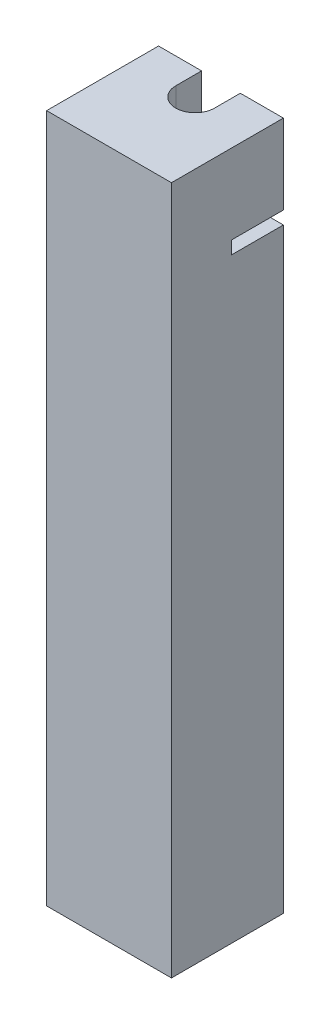
ISO-10303-21;
HEADER;
FILE_DESCRIPTION(('STEP AP214'),'2;1');
FILE_NAME('part.step','',(''),(''),'','','');
FILE_SCHEMA(('AUTOMOTIVE_DESIGN { 1 0 10303 214 1 1 1 1 }'));
ENDSEC;
DATA;
#1=APPLICATION_CONTEXT('core data for automotive mechanical design processes');
#2=APPLICATION_PROTOCOL_DEFINITION('international standard','automotive_design',2000,#1);
#3=PRODUCT_CONTEXT('',#1,'mechanical');
#4=PRODUCT('Part','Part','',(#3));
#5=PRODUCT_RELATED_PRODUCT_CATEGORY('part','',(#4));
#6=PRODUCT_DEFINITION_FORMATION('','',#4);
#7=PRODUCT_DEFINITION_CONTEXT('part definition',#1,'design');
#8=PRODUCT_DEFINITION('design','',#6,#7);
#9=PRODUCT_DEFINITION_SHAPE('','',#8);
#10=(LENGTH_UNIT() NAMED_UNIT(*) SI_UNIT(.MILLI.,.METRE.));
#11=(NAMED_UNIT(*) PLANE_ANGLE_UNIT() SI_UNIT($,.RADIAN.));
#12=(NAMED_UNIT(*) SI_UNIT($,.STERADIAN.) SOLID_ANGLE_UNIT());
#13=UNCERTAINTY_MEASURE_WITH_UNIT(LENGTH_MEASURE(1.E-05),#10,'distance_accuracy_value','');
#14=(GEOMETRIC_REPRESENTATION_CONTEXT(3) GLOBAL_UNCERTAINTY_ASSIGNED_CONTEXT((#13)) GLOBAL_UNIT_ASSIGNED_CONTEXT((#10,
#11,#12)) REPRESENTATION_CONTEXT('',''));
#15=CARTESIAN_POINT('',(0.,0.,0.));
#16=DIRECTION('',(0.,0.,1.));
#17=DIRECTION('',(1.,0.,0.));
#18=AXIS2_PLACEMENT_3D('',#15,#16,#17);
#19=CARTESIAN_POINT('',(0.,-30.75,10.));
#20=DIRECTION('',(0.,-1.,0.));
#21=DIRECTION('',(1.,0.,0.));
#22=AXIS2_PLACEMENT_3D('',#19,#20,#21);
#23=PLANE('',#22);
#24=CARTESIAN_POINT('',(0.,-30.75,0.));
#25=DIRECTION('',(0.,-1.,0.));
#26=DIRECTION('',(1.,0.,0.));
#27=AXIS2_PLACEMENT_3D('',#24,#25,#26);
#28=CIRCLE('',#27,2.25);
#29=CARTESIAN_POINT('',(2.25,-30.75,0.));
#30=VERTEX_POINT('',#29);
#31=EDGE_CURVE('E180',#30,#30,#28,.F.);
#32=ORIENTED_EDGE('',*,*,#31,.T.);
#33=EDGE_LOOP('',(#32));
#34=FACE_BOUND('',#33,.T.);
#35=ADVANCED_FACE('F35',(#34),#23,.F.);
#36=CARTESIAN_POINT('',(2.25,40.,0.));
#37=DIRECTION('',(1.,0.,0.));
#38=DIRECTION('',(0.,0.,-1.));
#39=AXIS2_PLACEMENT_3D('',#36,#37,#38);
#40=PLANE('',#39);
#41=DIRECTION('',(0.,-1.,0.));
#42=VECTOR('',#41,1.);
#43=CARTESIAN_POINT('',(2.25,40.,-3.));
#44=LINE('',#43,#42);
#45=CARTESIAN_POINT('',(2.25,29.25,-3.));
#46=VERTEX_POINT('',#45);
#47=CARTESIAN_POINT('',(2.25,-27.75,-3.));
#48=VERTEX_POINT('',#47);
#49=EDGE_CURVE('E245',#46,#48,#44,.T.);
#50=ORIENTED_EDGE('',*,*,#49,.T.);
#51=DIRECTION('',(0.,0.,-1.));
#52=VECTOR('',#51,1.);
#53=CARTESIAN_POINT('',(2.25,-27.75,0.));
#54=LINE('',#53,#52);
#55=CARTESIAN_POINT('',(2.25,-27.75,0.));
#56=VERTEX_POINT('',#55);
#57=EDGE_CURVE('E50',#56,#48,#54,.T.);
#58=ORIENTED_EDGE('',*,*,#57,.F.);
#59=DIRECTION('',(0.,-1.,0.));
#60=VECTOR('',#59,1.);
#61=CARTESIAN_POINT('',(2.25,40.,0.));
#62=LINE('',#61,#60);
#63=CARTESIAN_POINT('',(2.25,29.25,0.));
#64=VERTEX_POINT('',#63);
#65=EDGE_CURVE('E241',#64,#56,#62,.T.);
#66=ORIENTED_EDGE('',*,*,#65,.F.);
#67=DIRECTION('',(0.,0.,-1.));
#68=VECTOR('',#67,1.);
#69=CARTESIAN_POINT('',(2.25,29.25,0.));
#70=LINE('',#69,#68);
#71=EDGE_CURVE('E200',#64,#46,#70,.T.);
#72=ORIENTED_EDGE('',*,*,#71,.T.);
#73=EDGE_LOOP('',(#50,#58,#66,#72));
#74=FACE_BOUND('',#73,.T.);
#75=ADVANCED_FACE('F300',(#74),#40,.F.);
#76=CARTESIAN_POINT('',(0.,40.,0.));
#77=DIRECTION('',(0.,-1.,0.));
#78=DIRECTION('',(0.,0.,-1.));
#79=AXIS2_PLACEMENT_3D('',#76,#77,#78);
#80=CYLINDRICAL_SURFACE('',#79,2.25);
#81=ORIENTED_EDGE('',*,*,#31,.F.);
#82=EDGE_LOOP('',(#81));
#83=FACE_BOUND('',#82,.T.);
#84=ORIENTED_EDGE('',*,*,#65,.T.);
#85=CARTESIAN_POINT('',(0.,-27.75,0.));
#86=DIRECTION('',(0.,-1.,0.));
#87=DIRECTION('',(-1.,0.,0.));
#88=AXIS2_PLACEMENT_3D('',#85,#86,#87);
#89=CIRCLE('',#88,2.25);
#90=CARTESIAN_POINT('',(-2.25,-27.75,0.));
#91=VERTEX_POINT('',#90);
#92=EDGE_CURVE('E305',#91,#56,#89,.T.);
#93=ORIENTED_EDGE('',*,*,#92,.F.);
#94=DIRECTION('',(0.,-1.,0.));
#95=VECTOR('',#94,1.);
#96=CARTESIAN_POINT('',(-2.25,40.,0.));
#97=LINE('',#96,#95);
#98=CARTESIAN_POINT('',(-2.25,29.25,0.));
#99=VERTEX_POINT('',#98);
#100=EDGE_CURVE('E58',#99,#91,#97,.T.);
#101=ORIENTED_EDGE('',*,*,#100,.F.);
#102=CARTESIAN_POINT('',(0.,29.25,0.));
#103=DIRECTION('',(0.,-1.,0.));
#104=DIRECTION('',(0.,0.,-1.));
#105=AXIS2_PLACEMENT_3D('',#102,#103,#104);
#106=CIRCLE('',#105,2.25);
#107=EDGE_CURVE('E197',#99,#64,#106,.F.);
#108=ORIENTED_EDGE('',*,*,#107,.T.);
#109=EDGE_LOOP('',(#84,#93,#101,#108));
#110=FACE_BOUND('',#109,.T.);
#111=ADVANCED_FACE('F315',(#83,#110),#80,.F.);
#112=CARTESIAN_POINT('',(-2.25,40.,0.));
#113=DIRECTION('',(-1.,0.,0.));
#114=DIRECTION('',(0.,0.,1.));
#115=AXIS2_PLACEMENT_3D('',#112,#113,#114);
#116=PLANE('',#115);
#117=ORIENTED_EDGE('',*,*,#100,.T.);
#118=DIRECTION('',(0.,0.,1.));
#119=VECTOR('',#118,1.);
#120=CARTESIAN_POINT('',(-2.25,-27.75,-3.));
#121=LINE('',#120,#119);
#122=CARTESIAN_POINT('',(-2.25,-27.75,-3.));
#123=VERTEX_POINT('',#122);
#124=EDGE_CURVE('E307',#123,#91,#121,.T.);
#125=ORIENTED_EDGE('',*,*,#124,.F.);
#126=DIRECTION('',(0.,-1.,0.));
#127=VECTOR('',#126,1.);
#128=CARTESIAN_POINT('',(-2.25,40.,-3.));
#129=LINE('',#128,#127);
#130=CARTESIAN_POINT('',(-2.25,29.25,-3.));
#131=VERTEX_POINT('',#130);
#132=EDGE_CURVE('E234',#131,#123,#129,.T.);
#133=ORIENTED_EDGE('',*,*,#132,.F.);
#134=DIRECTION('',(0.,0.,1.));
#135=VECTOR('',#134,1.);
#136=CARTESIAN_POINT('',(-2.25,29.25,0.));
#137=LINE('',#136,#135);
#138=EDGE_CURVE('E195',#131,#99,#137,.T.);
#139=ORIENTED_EDGE('',*,*,#138,.T.);
#140=EDGE_LOOP('',(#117,#125,#133,#139));
#141=FACE_BOUND('',#140,.T.);
#142=ADVANCED_FACE('F318',(#141),#116,.F.);
#143=CARTESIAN_POINT('',(2.25,40.,-3.));
#144=DIRECTION('',(0.,0.,1.));
#145=DIRECTION('',(1.,0.,0.));
#146=AXIS2_PLACEMENT_3D('',#143,#144,#145);
#147=PLANE('',#146);
#148=DIRECTION('',(-1.,0.,0.));
#149=VECTOR('',#148,1.);
#150=CARTESIAN_POINT('',(0.,30.75,-3.));
#151=LINE('',#150,#149);
#152=CARTESIAN_POINT('',(7.25,30.75,-3.));
#153=VERTEX_POINT('',#152);
#154=CARTESIAN_POINT('',(2.25,30.75,-3.));
#155=VERTEX_POINT('',#154);
#156=EDGE_CURVE('E168',#153,#155,#151,.T.);
#157=ORIENTED_EDGE('',*,*,#156,.T.);
#158=CARTESIAN_POINT('',(2.25,40.,-3.));
#159=VERTEX_POINT('',#158);
#160=EDGE_CURVE('E246',#159,#155,#44,.T.);
#161=ORIENTED_EDGE('',*,*,#160,.F.);
#162=DIRECTION('',(-1.,0.,0.));
#163=VECTOR('',#162,1.);
#164=CARTESIAN_POINT('',(2.25,40.,-3.));
#165=LINE('',#164,#163);
#166=CARTESIAN_POINT('',(7.25,40.,-3.));
#167=VERTEX_POINT('',#166);
#168=EDGE_CURVE('E212',#167,#159,#165,.T.);
#169=ORIENTED_EDGE('',*,*,#168,.F.);
#170=DIRECTION('',(0.,-1.,0.));
#171=VECTOR('',#170,1.);
#172=CARTESIAN_POINT('',(7.25,40.,-3.));
#173=LINE('',#172,#171);
#174=EDGE_CURVE('E250',#167,#153,#173,.T.);
#175=ORIENTED_EDGE('',*,*,#174,.T.);
#176=EDGE_LOOP('',(#157,#161,#169,#175));
#177=FACE_BOUND('',#176,.T.);
#178=ADVANCED_FACE('F285',(#177),#147,.F.);
#179=DIRECTION('',(0.,0.,-1.));
#180=VECTOR('',#179,1.);
#181=CARTESIAN_POINT('',(2.25,30.75,0.));
#182=LINE('',#181,#180);
#183=CARTESIAN_POINT('',(2.25,30.75,0.));
#184=VERTEX_POINT('',#183);
#185=EDGE_CURVE('E193',#184,#155,#182,.T.);
#186=ORIENTED_EDGE('',*,*,#185,.F.);
#187=CARTESIAN_POINT('',(2.25,40.,0.));
#188=VERTEX_POINT('',#187);
#189=EDGE_CURVE('E242',#188,#184,#62,.T.);
#190=ORIENTED_EDGE('',*,*,#189,.F.);
#191=DIRECTION('',(0.,0.,1.));
#192=VECTOR('',#191,1.);
#193=CARTESIAN_POINT('',(2.25,40.,0.));
#194=LINE('',#193,#192);
#195=EDGE_CURVE('E214',#159,#188,#194,.T.);
#196=ORIENTED_EDGE('',*,*,#195,.F.);
#197=ORIENTED_EDGE('',*,*,#160,.T.);
#198=EDGE_LOOP('',(#186,#190,#196,#197));
#199=FACE_BOUND('',#198,.T.);
#200=ADVANCED_FACE('F281',(#199),#40,.F.);
#201=CARTESIAN_POINT('',(0.,30.75,0.));
#202=DIRECTION('',(0.,-1.,0.));
#203=DIRECTION('',(0.,0.,-1.));
#204=AXIS2_PLACEMENT_3D('',#201,#202,#203);
#205=CIRCLE('',#204,2.25);
#206=CARTESIAN_POINT('',(-2.25,30.75,0.));
#207=VERTEX_POINT('',#206);
#208=EDGE_CURVE('E191',#207,#184,#205,.F.);
#209=ORIENTED_EDGE('',*,*,#208,.F.);
#210=CARTESIAN_POINT('',(-2.25,40.,0.));
#211=VERTEX_POINT('',#210);
#212=EDGE_CURVE('E238',#211,#207,#97,.T.);
#213=ORIENTED_EDGE('',*,*,#212,.F.);
#214=CARTESIAN_POINT('',(0.,40.,0.));
#215=DIRECTION('',(0.,-1.,0.));
#216=DIRECTION('',(0.,0.,1.));
#217=AXIS2_PLACEMENT_3D('',#214,#215,#216);
#218=CIRCLE('',#217,2.25);
#219=EDGE_CURVE('E216',#188,#211,#218,.T.);
#220=ORIENTED_EDGE('',*,*,#219,.F.);
#221=ORIENTED_EDGE('',*,*,#189,.T.);
#222=EDGE_LOOP('',(#209,#213,#220,#221));
#223=FACE_BOUND('',#222,.T.);
#224=ADVANCED_FACE('F278',(#223),#80,.F.);
#225=DIRECTION('',(0.,0.,1.));
#226=VECTOR('',#225,1.);
#227=CARTESIAN_POINT('',(-2.25,30.75,0.));
#228=LINE('',#227,#226);
#229=CARTESIAN_POINT('',(-2.25,30.75,-3.));
#230=VERTEX_POINT('',#229);
#231=EDGE_CURVE('E185',#230,#207,#228,.T.);
#232=ORIENTED_EDGE('',*,*,#231,.F.);
#233=CARTESIAN_POINT('',(-2.25,40.,-3.));
#234=VERTEX_POINT('',#233);
#235=EDGE_CURVE('E235',#234,#230,#129,.T.);
#236=ORIENTED_EDGE('',*,*,#235,.F.);
#237=DIRECTION('',(0.,0.,-1.));
#238=VECTOR('',#237,1.);
#239=CARTESIAN_POINT('',(-2.25,40.,0.));
#240=LINE('',#239,#238);
#241=EDGE_CURVE('E218',#211,#234,#240,.T.);
#242=ORIENTED_EDGE('',*,*,#241,.F.);
#243=ORIENTED_EDGE('',*,*,#212,.T.);
#244=EDGE_LOOP('',(#232,#236,#242,#243));
#245=FACE_BOUND('',#244,.T.);
#246=ADVANCED_FACE('F265',(#245),#116,.F.);
#247=CARTESIAN_POINT('',(-7.25,40.,-3.));
#248=DIRECTION('',(0.,0.,1.));
#249=DIRECTION('',(1.,0.,0.));
#250=AXIS2_PLACEMENT_3D('',#247,#248,#249);
#251=PLANE('',#250);
#252=DIRECTION('',(1.,0.,0.));
#253=VECTOR('',#252,1.);
#254=CARTESIAN_POINT('',(-7.25,30.75,-3.));
#255=LINE('',#254,#253);
#256=CARTESIAN_POINT('',(-7.25,30.75,-3.));
#257=VERTEX_POINT('',#256);
#258=EDGE_CURVE('E43',#257,#230,#255,.T.);
#259=ORIENTED_EDGE('',*,*,#258,.F.);
#260=DIRECTION('',(0.,-1.,0.));
#261=VECTOR('',#260,1.);
#262=CARTESIAN_POINT('',(-7.25,40.,-3.));
#263=LINE('',#262,#261);
#264=CARTESIAN_POINT('',(-7.25,40.,-3.));
#265=VERTEX_POINT('',#264);
#266=EDGE_CURVE('E232',#265,#257,#263,.T.);
#267=ORIENTED_EDGE('',*,*,#266,.F.);
#268=DIRECTION('',(-1.,0.,0.));
#269=VECTOR('',#268,1.);
#270=CARTESIAN_POINT('',(-7.25,40.,-3.));
#271=LINE('',#270,#269);
#272=EDGE_CURVE('E220',#234,#265,#271,.T.);
#273=ORIENTED_EDGE('',*,*,#272,.F.);
#274=ORIENTED_EDGE('',*,*,#235,.T.);
#275=EDGE_LOOP('',(#259,#267,#273,#274));
#276=FACE_BOUND('',#275,.T.);
#277=ADVANCED_FACE('F269',(#276),#251,.F.);
#278=CARTESIAN_POINT('',(-7.25,40.,-3.));
#279=DIRECTION('',(1.,0.,0.));
#280=DIRECTION('',(0.,0.,-1.));
#281=AXIS2_PLACEMENT_3D('',#278,#279,#280);
#282=PLANE('',#281);
#283=DIRECTION('',(0.,0.,1.));
#284=VECTOR('',#283,1.);
#285=CARTESIAN_POINT('',(-7.25,-40.,-3.));
#286=LINE('',#285,#284);
#287=CARTESIAN_POINT('',(-7.25,-40.,-3.));
#288=VERTEX_POINT('',#287);
#289=CARTESIAN_POINT('',(-7.25,-40.,10.));
#290=VERTEX_POINT('',#289);
#291=EDGE_CURVE('E203',#288,#290,#286,.T.);
#292=ORIENTED_EDGE('',*,*,#291,.T.);
#293=DIRECTION('',(0.,-1.,0.));
#294=VECTOR('',#293,1.);
#295=CARTESIAN_POINT('',(-7.25,40.,10.));
#296=LINE('',#295,#294);
#297=CARTESIAN_POINT('',(-7.25,40.,10.));
#298=VERTEX_POINT('',#297);
#299=EDGE_CURVE('E255',#298,#290,#296,.T.);
#300=ORIENTED_EDGE('',*,*,#299,.F.);
#301=DIRECTION('',(0.,0.,1.));
#302=VECTOR('',#301,1.);
#303=CARTESIAN_POINT('',(-7.25,40.,-3.));
#304=LINE('',#303,#302);
#305=EDGE_CURVE('E204',#265,#298,#304,.T.);
#306=ORIENTED_EDGE('',*,*,#305,.F.);
#307=ORIENTED_EDGE('',*,*,#266,.T.);
#308=DIRECTION('',(0.,0.,-1.));
#309=VECTOR('',#308,1.);
#310=CARTESIAN_POINT('',(-7.25,30.75,3.00000000000001));
#311=LINE('',#310,#309);
#312=CARTESIAN_POINT('',(-7.25,30.75,3.00000000000001));
#313=VERTEX_POINT('',#312);
#314=EDGE_CURVE('E157',#313,#257,#311,.T.);
#315=ORIENTED_EDGE('',*,*,#314,.F.);
#316=DIRECTION('',(0.,1.,0.));
#317=VECTOR('',#316,1.);
#318=CARTESIAN_POINT('',(-7.25,0.,3.00000000000001));
#319=LINE('',#318,#317);
#320=CARTESIAN_POINT('',(-7.25,29.25,3.00000000000001));
#321=VERTEX_POINT('',#320);
#322=EDGE_CURVE('E164',#321,#313,#319,.T.);
#323=ORIENTED_EDGE('',*,*,#322,.F.);
#324=DIRECTION('',(0.,0.,-1.));
#325=VECTOR('',#324,1.);
#326=CARTESIAN_POINT('',(-7.25,29.25,3.00000000000001));
#327=LINE('',#326,#325);
#328=CARTESIAN_POINT('',(-7.25,29.25,-2.99999999999999));
#329=VERTEX_POINT('',#328);
#330=EDGE_CURVE('E149',#321,#329,#327,.T.);
#331=ORIENTED_EDGE('',*,*,#330,.T.);
#332=EDGE_CURVE('E222',#329,#288,#263,.T.);
#333=ORIENTED_EDGE('',*,*,#332,.T.);
#334=EDGE_LOOP('',(#292,#300,#306,#307,#315,#323,#331,#333));
#335=FACE_BOUND('',#334,.T.);
#336=ADVANCED_FACE('F37',(#335),#282,.F.);
#337=CARTESIAN_POINT('',(-7.25,40.,10.));
#338=DIRECTION('',(0.,0.,-1.));
#339=DIRECTION('',(-1.,0.,0.));
#340=AXIS2_PLACEMENT_3D('',#337,#338,#339);
#341=PLANE('',#340);
#342=DIRECTION('',(1.,0.,0.));
#343=VECTOR('',#342,1.);
#344=CARTESIAN_POINT('',(-7.25,-40.,10.));
#345=LINE('',#344,#343);
#346=CARTESIAN_POINT('',(7.25,-40.,10.));
#347=VERTEX_POINT('',#346);
#348=EDGE_CURVE('E224',#290,#347,#345,.T.);
#349=ORIENTED_EDGE('',*,*,#348,.T.);
#350=DIRECTION('',(0.,-1.,0.));
#351=VECTOR('',#350,1.);
#352=CARTESIAN_POINT('',(7.25,40.,10.));
#353=LINE('',#352,#351);
#354=CARTESIAN_POINT('',(7.25,40.,10.));
#355=VERTEX_POINT('',#354);
#356=EDGE_CURVE('E253',#355,#347,#353,.T.);
#357=ORIENTED_EDGE('',*,*,#356,.F.);
#358=DIRECTION('',(1.,0.,0.));
#359=VECTOR('',#358,1.);
#360=CARTESIAN_POINT('',(-7.25,40.,10.));
#361=LINE('',#360,#359);
#362=EDGE_CURVE('E207',#298,#355,#361,.T.);
#363=ORIENTED_EDGE('',*,*,#362,.F.);
#364=ORIENTED_EDGE('',*,*,#299,.T.);
#365=EDGE_LOOP('',(#349,#357,#363,#364));
#366=FACE_BOUND('',#365,.T.);
#367=ADVANCED_FACE('F328',(#366),#341,.F.);
#368=CARTESIAN_POINT('',(7.25,40.,-3.));
#369=DIRECTION('',(-1.,0.,0.));
#370=DIRECTION('',(0.,0.,1.));
#371=AXIS2_PLACEMENT_3D('',#368,#369,#370);
#372=PLANE('',#371);
#373=DIRECTION('',(0.,0.,-1.));
#374=VECTOR('',#373,1.);
#375=CARTESIAN_POINT('',(7.25,-40.,-3.));
#376=LINE('',#375,#374);
#377=CARTESIAN_POINT('',(7.25,-40.,-3.));
#378=VERTEX_POINT('',#377);
#379=EDGE_CURVE('E227',#347,#378,#376,.T.);
#380=ORIENTED_EDGE('',*,*,#379,.T.);
#381=CARTESIAN_POINT('',(7.25,29.25,-3.));
#382=VERTEX_POINT('',#381);
#383=EDGE_CURVE('E249',#382,#378,#173,.T.);
#384=ORIENTED_EDGE('',*,*,#383,.F.);
#385=DIRECTION('',(0.,0.,-1.));
#386=VECTOR('',#385,1.);
#387=CARTESIAN_POINT('',(7.25,29.25,3.));
#388=LINE('',#387,#386);
#389=CARTESIAN_POINT('',(7.25,29.25,3.));
#390=VERTEX_POINT('',#389);
#391=EDGE_CURVE('E183',#390,#382,#388,.T.);
#392=ORIENTED_EDGE('',*,*,#391,.F.);
#393=DIRECTION('',(0.,-1.,0.));
#394=VECTOR('',#393,1.);
#395=CARTESIAN_POINT('',(7.25,0.,3.));
#396=LINE('',#395,#394);
#397=CARTESIAN_POINT('',(7.25,30.75,3.));
#398=VERTEX_POINT('',#397);
#399=EDGE_CURVE('E158',#398,#390,#396,.T.);
#400=ORIENTED_EDGE('',*,*,#399,.F.);
#401=DIRECTION('',(0.,0.,-1.));
#402=VECTOR('',#401,1.);
#403=CARTESIAN_POINT('',(7.25,30.75,3.));
#404=LINE('',#403,#402);
#405=EDGE_CURVE('E186',#398,#153,#404,.T.);
#406=ORIENTED_EDGE('',*,*,#405,.T.);
#407=ORIENTED_EDGE('',*,*,#174,.F.);
#408=DIRECTION('',(0.,0.,-1.));
#409=VECTOR('',#408,1.);
#410=CARTESIAN_POINT('',(7.25,40.,-3.));
#411=LINE('',#410,#409);
#412=EDGE_CURVE('E210',#355,#167,#411,.T.);
#413=ORIENTED_EDGE('',*,*,#412,.F.);
#414=ORIENTED_EDGE('',*,*,#356,.T.);
#415=EDGE_LOOP('',(#380,#384,#392,#400,#406,#407,#413,#414));
#416=FACE_BOUND('',#415,.T.);
#417=ADVANCED_FACE('F288',(#416),#372,.F.);
#418=DIRECTION('',(-1.,0.,0.));
#419=VECTOR('',#418,1.);
#420=CARTESIAN_POINT('',(-7.25,-40.,-3.));
#421=LINE('',#420,#419);
#422=EDGE_CURVE('E208',#378,#288,#421,.T.);
#423=ORIENTED_EDGE('',*,*,#422,.T.);
#424=ORIENTED_EDGE('',*,*,#332,.F.);
#425=DIRECTION('',(1.,0.,0.));
#426=VECTOR('',#425,1.);
#427=CARTESIAN_POINT('',(-7.25,29.25,-3.));
#428=LINE('',#427,#426);
#429=EDGE_CURVE('E11',#329,#131,#428,.T.);
#430=ORIENTED_EDGE('',*,*,#429,.T.);
#431=ORIENTED_EDGE('',*,*,#132,.T.);
#432=DIRECTION('',(-1.,0.,0.));
#433=VECTOR('',#432,1.);
#434=CARTESIAN_POINT('',(2.25,-27.75,-3.));
#435=LINE('',#434,#433);
#436=EDGE_CURVE('E299',#48,#123,#435,.T.);
#437=ORIENTED_EDGE('',*,*,#436,.F.);
#438=ORIENTED_EDGE('',*,*,#49,.F.);
#439=DIRECTION('',(-1.,0.,0.));
#440=VECTOR('',#439,1.);
#441=CARTESIAN_POINT('',(0.,29.25,-3.));
#442=LINE('',#441,#440);
#443=EDGE_CURVE('E178',#382,#46,#442,.T.);
#444=ORIENTED_EDGE('',*,*,#443,.F.);
#445=ORIENTED_EDGE('',*,*,#383,.T.);
#446=EDGE_LOOP('',(#423,#424,#430,#431,#437,#438,#444,#445));
#447=FACE_BOUND('',#446,.T.);
#448=ADVANCED_FACE('F294',(#447),#251,.F.);
#449=CARTESIAN_POINT('',(0.,40.,0.));
#450=DIRECTION('',(0.,1.,0.));
#451=DIRECTION('',(0.,0.,1.));
#452=AXIS2_PLACEMENT_3D('',#449,#450,#451);
#453=PLANE('',#452);
#454=ORIENTED_EDGE('',*,*,#305,.T.);
#455=ORIENTED_EDGE('',*,*,#362,.T.);
#456=ORIENTED_EDGE('',*,*,#412,.T.);
#457=ORIENTED_EDGE('',*,*,#168,.T.);
#458=ORIENTED_EDGE('',*,*,#195,.T.);
#459=ORIENTED_EDGE('',*,*,#219,.T.);
#460=ORIENTED_EDGE('',*,*,#241,.T.);
#461=ORIENTED_EDGE('',*,*,#272,.T.);
#462=EDGE_LOOP('',(#454,#455,#456,#457,#458,#459,#460,#461));
#463=FACE_BOUND('',#462,.T.);
#464=ADVANCED_FACE('F272',(#463),#453,.T.);
#465=CARTESIAN_POINT('',(0.,-40.,0.));
#466=DIRECTION('',(0.,1.,0.));
#467=DIRECTION('',(0.,0.,1.));
#468=AXIS2_PLACEMENT_3D('',#465,#466,#467);
#469=PLANE('',#468);
#470=ORIENTED_EDGE('',*,*,#291,.F.);
#471=ORIENTED_EDGE('',*,*,#422,.F.);
#472=ORIENTED_EDGE('',*,*,#379,.F.);
#473=ORIENTED_EDGE('',*,*,#348,.F.);
#474=EDGE_LOOP('',(#470,#471,#472,#473));
#475=FACE_BOUND('',#474,.T.);
#476=ADVANCED_FACE('F324',(#475),#469,.F.);
#477=CARTESIAN_POINT('',(0.,29.25,3.));
#478=DIRECTION('',(0.,-1.,0.));
#479=DIRECTION('',(0.,0.,-1.));
#480=AXIS2_PLACEMENT_3D('',#477,#478,#479);
#481=PLANE('',#480);
#482=ORIENTED_EDGE('',*,*,#107,.F.);
#483=ORIENTED_EDGE('',*,*,#138,.F.);
#484=ORIENTED_EDGE('',*,*,#429,.F.);
#485=ORIENTED_EDGE('',*,*,#330,.F.);
#486=DIRECTION('',(-1.,0.,0.));
#487=VECTOR('',#486,1.);
#488=CARTESIAN_POINT('',(0.,29.25,3.));
#489=LINE('',#488,#487);
#490=EDGE_CURVE('E152',#390,#321,#489,.T.);
#491=ORIENTED_EDGE('',*,*,#490,.F.);
#492=ORIENTED_EDGE('',*,*,#391,.T.);
#493=ORIENTED_EDGE('',*,*,#443,.T.);
#494=ORIENTED_EDGE('',*,*,#71,.F.);
#495=EDGE_LOOP('',(#482,#483,#484,#485,#491,#492,#493,#494));
#496=FACE_BOUND('',#495,.T.);
#497=ADVANCED_FACE('F151',(#496),#481,.F.);
#498=CARTESIAN_POINT('',(0.,30.75,3.));
#499=DIRECTION('',(0.,-1.,0.));
#500=DIRECTION('',(0.,0.,-1.));
#501=AXIS2_PLACEMENT_3D('',#498,#499,#500);
#502=PLANE('',#501);
#503=ORIENTED_EDGE('',*,*,#185,.T.);
#504=ORIENTED_EDGE('',*,*,#156,.F.);
#505=ORIENTED_EDGE('',*,*,#405,.F.);
#506=DIRECTION('',(-1.,0.,0.));
#507=VECTOR('',#506,1.);
#508=CARTESIAN_POINT('',(0.,30.75,3.));
#509=LINE('',#508,#507);
#510=EDGE_CURVE('E172',#398,#313,#509,.T.);
#511=ORIENTED_EDGE('',*,*,#510,.T.);
#512=ORIENTED_EDGE('',*,*,#314,.T.);
#513=ORIENTED_EDGE('',*,*,#258,.T.);
#514=ORIENTED_EDGE('',*,*,#231,.T.);
#515=ORIENTED_EDGE('',*,*,#208,.T.);
#516=EDGE_LOOP('',(#503,#504,#505,#511,#512,#513,#514,#515));
#517=FACE_BOUND('',#516,.T.);
#518=ADVANCED_FACE('F259',(#517),#502,.T.);
#519=CARTESIAN_POINT('',(0.,0.,3.));
#520=DIRECTION('',(0.,0.,-1.));
#521=DIRECTION('',(-1.,0.,0.));
#522=AXIS2_PLACEMENT_3D('',#519,#520,#521);
#523=PLANE('',#522);
#524=ORIENTED_EDGE('',*,*,#490,.T.);
#525=ORIENTED_EDGE('',*,*,#322,.T.);
#526=ORIENTED_EDGE('',*,*,#510,.F.);
#527=ORIENTED_EDGE('',*,*,#399,.T.);
#528=EDGE_LOOP('',(#524,#525,#526,#527));
#529=FACE_BOUND('',#528,.T.);
#530=ADVANCED_FACE('F162',(#529),#523,.T.);
#531=CARTESIAN_POINT('',(0.,-27.75,0.));
#532=DIRECTION('',(0.,1.,0.));
#533=DIRECTION('',(-1.,0.,0.));
#534=AXIS2_PLACEMENT_3D('',#531,#532,#533);
#535=PLANE('',#534);
#536=ORIENTED_EDGE('',*,*,#92,.T.);
#537=ORIENTED_EDGE('',*,*,#57,.T.);
#538=ORIENTED_EDGE('',*,*,#436,.T.);
#539=ORIENTED_EDGE('',*,*,#124,.T.);
#540=EDGE_LOOP('',(#536,#537,#538,#539));
#541=FACE_BOUND('',#540,.T.);
#542=ADVANCED_FACE('F303',(#541),#535,.T.);
#543=CLOSED_SHELL('',(#35,#75,#111,#142,#178,#200,#224,#246,#277,#336,#367,#417,#448,#464,#476,
#497,#518,#530,#542));
#544=MANIFOLD_SOLID_BREP('B2',#543);
#545=ADVANCED_BREP_SHAPE_REPRESENTATION('',(#18,#544),#14);
#546=SHAPE_DEFINITION_REPRESENTATION(#9,#545);
ENDSEC;
END-ISO-10303-21;
